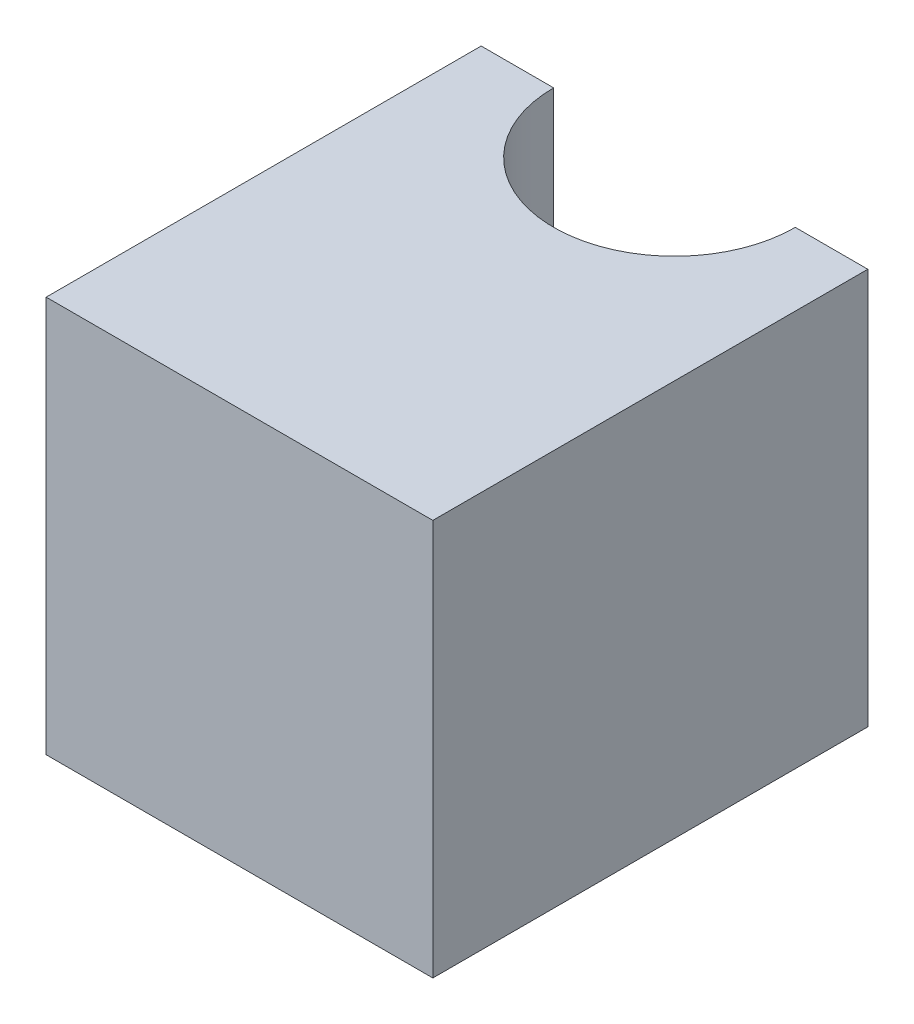
ISO-10303-21;
HEADER;
FILE_DESCRIPTION(('STEP AP214'),'2;1');
FILE_NAME('part.step','',(''),(''),'','','');
FILE_SCHEMA(('AUTOMOTIVE_DESIGN { 1 0 10303 214 1 1 1 1 }'));
ENDSEC;
DATA;
#1=APPLICATION_CONTEXT('core data for automotive mechanical design processes');
#2=APPLICATION_PROTOCOL_DEFINITION('international standard','automotive_design',2000,#1);
#3=PRODUCT_CONTEXT('',#1,'mechanical');
#4=PRODUCT('Part','Part','',(#3));
#5=PRODUCT_RELATED_PRODUCT_CATEGORY('part','',(#4));
#6=PRODUCT_DEFINITION_FORMATION('','',#4);
#7=PRODUCT_DEFINITION_CONTEXT('part definition',#1,'design');
#8=PRODUCT_DEFINITION('design','',#6,#7);
#9=PRODUCT_DEFINITION_SHAPE('','',#8);
#10=(LENGTH_UNIT() NAMED_UNIT(*) SI_UNIT(.MILLI.,.METRE.));
#11=(NAMED_UNIT(*) PLANE_ANGLE_UNIT() SI_UNIT($,.RADIAN.));
#12=(NAMED_UNIT(*) SI_UNIT($,.STERADIAN.) SOLID_ANGLE_UNIT());
#13=UNCERTAINTY_MEASURE_WITH_UNIT(LENGTH_MEASURE(1.E-05),#10,'distance_accuracy_value','');
#14=(GEOMETRIC_REPRESENTATION_CONTEXT(3) GLOBAL_UNCERTAINTY_ASSIGNED_CONTEXT((#13)) GLOBAL_UNIT_ASSIGNED_CONTEXT((#10,
#11,#12)) REPRESENTATION_CONTEXT('',''));
#15=CARTESIAN_POINT('',(0.,0.,0.));
#16=DIRECTION('',(0.,0.,1.));
#17=DIRECTION('',(1.,0.,0.));
#18=AXIS2_PLACEMENT_3D('',#15,#16,#17);
#19=CARTESIAN_POINT('',(-3.7,0.,-6.1));
#20=DIRECTION('',(0.,1.,0.));
#21=DIRECTION('',(0.,0.,1.));
#22=AXIS2_PLACEMENT_3D('',#19,#20,#21);
#23=CYLINDRICAL_SURFACE('',#22,0.25);
#24=DIRECTION('',(0.,1.,0.));
#25=VECTOR('',#24,1.);
#26=CARTESIAN_POINT('',(-3.95,0.,-6.1));
#27=LINE('',#26,#25);
#28=CARTESIAN_POINT('',(-3.95,0.82,-6.1));
#29=VERTEX_POINT('',#28);
#30=CARTESIAN_POINT('',(-3.95,0.,-6.1));
#31=VERTEX_POINT('',#30);
#32=EDGE_CURVE('E119',#29,#31,#27,.F.);
#33=ORIENTED_EDGE('',*,*,#32,.F.);
#34=CARTESIAN_POINT('',(-3.7,0.82,-6.1));
#35=DIRECTION('',(0.,1.,0.));
#36=DIRECTION('',(0.,0.,1.));
#37=AXIS2_PLACEMENT_3D('',#34,#35,#36);
#38=CIRCLE('',#37,0.25);
#39=CARTESIAN_POINT('',(-3.45,0.82,-6.1));
#40=VERTEX_POINT('',#39);
#41=EDGE_CURVE('E80',#40,#29,#38,.F.);
#42=ORIENTED_EDGE('',*,*,#41,.F.);
#43=DIRECTION('',(0.,1.,0.));
#44=VECTOR('',#43,1.);
#45=CARTESIAN_POINT('',(-3.45,0.,-6.1));
#46=LINE('',#45,#44);
#47=CARTESIAN_POINT('',(-3.45,0.,-6.1));
#48=VERTEX_POINT('',#47);
#49=EDGE_CURVE('E78',#48,#40,#46,.T.);
#50=ORIENTED_EDGE('',*,*,#49,.F.);
#51=CARTESIAN_POINT('',(-3.7,0.,-6.1));
#52=DIRECTION('',(0.,1.,0.));
#53=DIRECTION('',(0.,0.,1.));
#54=AXIS2_PLACEMENT_3D('',#51,#52,#53);
#55=CIRCLE('',#54,0.25);
#56=EDGE_CURVE('E20',#48,#31,#55,.F.);
#57=ORIENTED_EDGE('',*,*,#56,.T.);
#58=EDGE_LOOP('',(#33,#42,#50,#57));
#59=FACE_BOUND('',#58,.T.);
#60=ADVANCED_FACE('F17',(#59),#23,.F.);
#61=CARTESIAN_POINT('',(-3.95,0.,-6.1));
#62=DIRECTION('',(0.,0.,-1.));
#63=DIRECTION('',(-1.,0.,0.));
#64=AXIS2_PLACEMENT_3D('',#61,#62,#63);
#65=PLANE('',#64);
#66=DIRECTION('',(1.,0.,0.));
#67=VECTOR('',#66,1.);
#68=CARTESIAN_POINT('',(-3.7,0.82,-6.1));
#69=LINE('',#68,#67);
#70=CARTESIAN_POINT('',(-4.1,0.82,-6.1));
#71=VERTEX_POINT('',#70);
#72=EDGE_CURVE('E104',#29,#71,#69,.F.);
#73=ORIENTED_EDGE('',*,*,#72,.F.);
#74=ORIENTED_EDGE('',*,*,#32,.T.);
#75=DIRECTION('',(1.,0.,0.));
#76=VECTOR('',#75,1.);
#77=CARTESIAN_POINT('',(-3.7,0.,-6.1));
#78=LINE('',#77,#76);
#79=CARTESIAN_POINT('',(-4.1,0.,-6.1));
#80=VERTEX_POINT('',#79);
#81=EDGE_CURVE('E73',#31,#80,#78,.F.);
#82=ORIENTED_EDGE('',*,*,#81,.T.);
#83=DIRECTION('',(0.,1.,0.));
#84=VECTOR('',#83,1.);
#85=CARTESIAN_POINT('',(-4.1,0.,-6.1));
#86=LINE('',#85,#84);
#87=EDGE_CURVE('E76',#71,#80,#86,.F.);
#88=ORIENTED_EDGE('',*,*,#87,.F.);
#89=EDGE_LOOP('',(#73,#74,#82,#88));
#90=FACE_BOUND('',#89,.T.);
#91=ADVANCED_FACE('F196',(#90),#65,.T.);
#92=CARTESIAN_POINT('',(-4.1,0.,-6.1));
#93=DIRECTION('',(-1.,0.,0.));
#94=DIRECTION('',(0.,0.,1.));
#95=AXIS2_PLACEMENT_3D('',#92,#93,#94);
#96=PLANE('',#95);
#97=DIRECTION('',(0.,0.,1.));
#98=VECTOR('',#97,1.);
#99=CARTESIAN_POINT('',(-4.1,0.82,-5.65));
#100=LINE('',#99,#98);
#101=CARTESIAN_POINT('',(-4.1,0.82,-5.2));
#102=VERTEX_POINT('',#101);
#103=EDGE_CURVE('E83',#71,#102,#100,.T.);
#104=ORIENTED_EDGE('',*,*,#103,.F.);
#105=ORIENTED_EDGE('',*,*,#87,.T.);
#106=DIRECTION('',(0.,0.,1.));
#107=VECTOR('',#106,1.);
#108=CARTESIAN_POINT('',(-4.1,0.,-5.65));
#109=LINE('',#108,#107);
#110=CARTESIAN_POINT('',(-4.1,0.,-5.2));
#111=VERTEX_POINT('',#110);
#112=EDGE_CURVE('E89',#80,#111,#109,.T.);
#113=ORIENTED_EDGE('',*,*,#112,.T.);
#114=DIRECTION('',(0.,1.,0.));
#115=VECTOR('',#114,1.);
#116=CARTESIAN_POINT('',(-4.1,0.,-5.2));
#117=LINE('',#116,#115);
#118=EDGE_CURVE('E100',#102,#111,#117,.F.);
#119=ORIENTED_EDGE('',*,*,#118,.F.);
#120=EDGE_LOOP('',(#104,#105,#113,#119));
#121=FACE_BOUND('',#120,.T.);
#122=ADVANCED_FACE('F187',(#121),#96,.T.);
#123=CARTESIAN_POINT('',(-3.7,0.,-5.65));
#124=DIRECTION('',(0.,1.,0.));
#125=DIRECTION('',(0.,0.,1.));
#126=AXIS2_PLACEMENT_3D('',#123,#124,#125);
#127=PLANE('',#126);
#128=ORIENTED_EDGE('',*,*,#81,.F.);
#129=ORIENTED_EDGE('',*,*,#56,.F.);
#130=DIRECTION('',(-1.,0.,0.));
#131=VECTOR('',#130,1.);
#132=CARTESIAN_POINT('',(-3.3,0.,-6.1));
#133=LINE('',#132,#131);
#134=CARTESIAN_POINT('',(-3.3,0.,-6.1));
#135=VERTEX_POINT('',#134);
#136=EDGE_CURVE('E70',#135,#48,#133,.T.);
#137=ORIENTED_EDGE('',*,*,#136,.F.);
#138=DIRECTION('',(0.,0.,-1.));
#139=VECTOR('',#138,1.);
#140=CARTESIAN_POINT('',(-3.3,0.,-5.2));
#141=LINE('',#140,#139);
#142=CARTESIAN_POINT('',(-3.3,0.,-5.2));
#143=VERTEX_POINT('',#142);
#144=EDGE_CURVE('E98',#143,#135,#141,.T.);
#145=ORIENTED_EDGE('',*,*,#144,.F.);
#146=DIRECTION('',(1.,0.,0.));
#147=VECTOR('',#146,1.);
#148=CARTESIAN_POINT('',(-4.1,0.,-5.2));
#149=LINE('',#148,#147);
#150=EDGE_CURVE('E107',#111,#143,#149,.T.);
#151=ORIENTED_EDGE('',*,*,#150,.F.);
#152=ORIENTED_EDGE('',*,*,#112,.F.);
#153=EDGE_LOOP('',(#128,#129,#137,#145,#151,#152));
#154=FACE_BOUND('',#153,.T.);
#155=ADVANCED_FACE('F68',(#154),#127,.F.);
#156=CARTESIAN_POINT('',(-3.3,0.,-6.1));
#157=DIRECTION('',(0.,0.,-1.));
#158=DIRECTION('',(-1.,0.,0.));
#159=AXIS2_PLACEMENT_3D('',#156,#157,#158);
#160=PLANE('',#159);
#161=DIRECTION('',(1.,0.,0.));
#162=VECTOR('',#161,1.);
#163=CARTESIAN_POINT('',(-3.7,0.82,-6.1));
#164=LINE('',#163,#162);
#165=CARTESIAN_POINT('',(-3.3,0.82,-6.1));
#166=VERTEX_POINT('',#165);
#167=EDGE_CURVE('E105',#166,#40,#164,.F.);
#168=ORIENTED_EDGE('',*,*,#167,.F.);
#169=DIRECTION('',(0.,1.,0.));
#170=VECTOR('',#169,1.);
#171=CARTESIAN_POINT('',(-3.3,0.,-6.1));
#172=LINE('',#171,#170);
#173=EDGE_CURVE('E87',#135,#166,#172,.T.);
#174=ORIENTED_EDGE('',*,*,#173,.F.);
#175=ORIENTED_EDGE('',*,*,#136,.T.);
#176=ORIENTED_EDGE('',*,*,#49,.T.);
#177=EDGE_LOOP('',(#168,#174,#175,#176));
#178=FACE_BOUND('',#177,.T.);
#179=ADVANCED_FACE('F85',(#178),#160,.T.);
#180=CARTESIAN_POINT('',(-3.7,0.82,-5.65));
#181=DIRECTION('',(0.,1.,0.));
#182=DIRECTION('',(0.,0.,1.));
#183=AXIS2_PLACEMENT_3D('',#180,#181,#182);
#184=PLANE('',#183);
#185=ORIENTED_EDGE('',*,*,#41,.T.);
#186=ORIENTED_EDGE('',*,*,#72,.T.);
#187=ORIENTED_EDGE('',*,*,#103,.T.);
#188=DIRECTION('',(1.,0.,0.));
#189=VECTOR('',#188,1.);
#190=CARTESIAN_POINT('',(-4.1,0.82,-5.2));
#191=LINE('',#190,#189);
#192=CARTESIAN_POINT('',(-3.3,0.82,-5.2));
#193=VERTEX_POINT('',#192);
#194=EDGE_CURVE('E35',#193,#102,#191,.F.);
#195=ORIENTED_EDGE('',*,*,#194,.F.);
#196=DIRECTION('',(0.,0.,-1.));
#197=VECTOR('',#196,1.);
#198=CARTESIAN_POINT('',(-3.3,0.82,-5.2));
#199=LINE('',#198,#197);
#200=EDGE_CURVE('E26',#166,#193,#199,.F.);
#201=ORIENTED_EDGE('',*,*,#200,.F.);
#202=ORIENTED_EDGE('',*,*,#167,.T.);
#203=EDGE_LOOP('',(#185,#186,#187,#195,#201,#202));
#204=FACE_BOUND('',#203,.T.);
#205=ADVANCED_FACE('F145',(#204),#184,.T.);
#206=CARTESIAN_POINT('',(-4.1,0.,-5.2));
#207=DIRECTION('',(0.,0.,1.));
#208=DIRECTION('',(1.,0.,0.));
#209=AXIS2_PLACEMENT_3D('',#206,#207,#208);
#210=PLANE('',#209);
#211=ORIENTED_EDGE('',*,*,#194,.T.);
#212=ORIENTED_EDGE('',*,*,#118,.T.);
#213=ORIENTED_EDGE('',*,*,#150,.T.);
#214=DIRECTION('',(0.,1.,0.));
#215=VECTOR('',#214,1.);
#216=CARTESIAN_POINT('',(-3.3,0.,-5.2));
#217=LINE('',#216,#215);
#218=EDGE_CURVE('E11',#193,#143,#217,.F.);
#219=ORIENTED_EDGE('',*,*,#218,.F.);
#220=EDGE_LOOP('',(#211,#212,#213,#219));
#221=FACE_BOUND('',#220,.T.);
#222=ADVANCED_FACE('F141',(#221),#210,.T.);
#223=CARTESIAN_POINT('',(-3.3,0.,-5.2));
#224=DIRECTION('',(1.,0.,0.));
#225=DIRECTION('',(0.,0.,-1.));
#226=AXIS2_PLACEMENT_3D('',#223,#224,#225);
#227=PLANE('',#226);
#228=ORIENTED_EDGE('',*,*,#200,.T.);
#229=ORIENTED_EDGE('',*,*,#218,.T.);
#230=ORIENTED_EDGE('',*,*,#144,.T.);
#231=ORIENTED_EDGE('',*,*,#173,.T.);
#232=EDGE_LOOP('',(#228,#229,#230,#231));
#233=FACE_BOUND('',#232,.T.);
#234=ADVANCED_FACE('F144',(#233),#227,.T.);
#235=CLOSED_SHELL('',(#60,#91,#122,#155,#179,#205,#222,#234));
#236=MANIFOLD_SOLID_BREP('B1',#235);
#237=ADVANCED_BREP_SHAPE_REPRESENTATION('',(#18,#236),#14);
#238=SHAPE_DEFINITION_REPRESENTATION(#9,#237);
ENDSEC;
END-ISO-10303-21;
